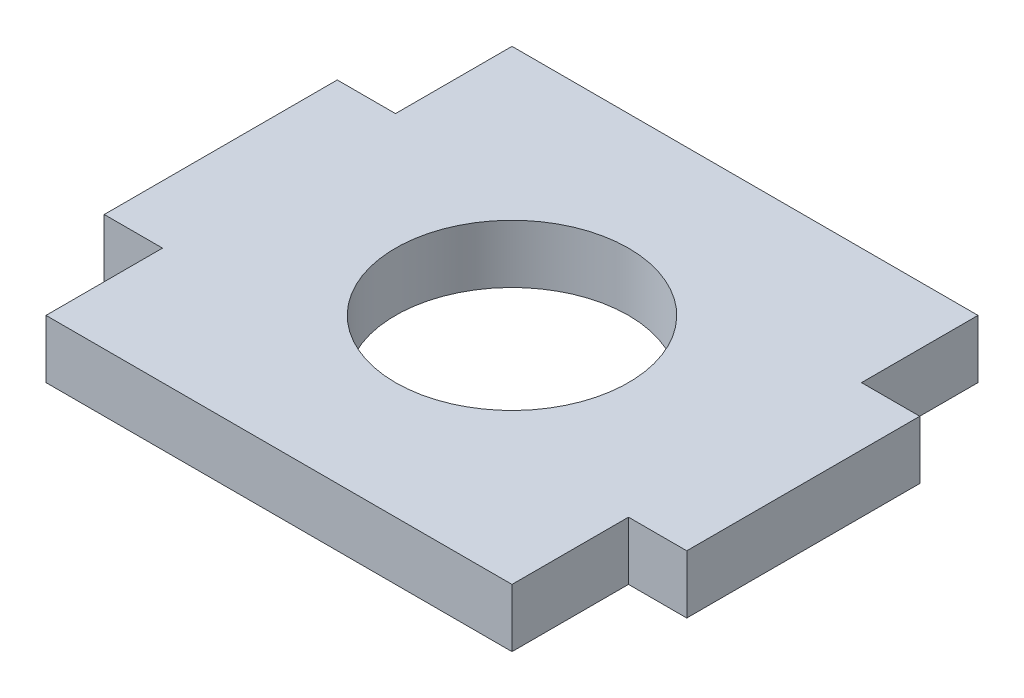
ISO-10303-21;
HEADER;
FILE_DESCRIPTION(('STEP AP214'),'2;1');
FILE_NAME('part.step','',(''),(''),'','','');
FILE_SCHEMA(('AUTOMOTIVE_DESIGN { 1 0 10303 214 1 1 1 1 }'));
ENDSEC;
DATA;
#1=APPLICATION_CONTEXT('core data for automotive mechanical design processes');
#2=APPLICATION_PROTOCOL_DEFINITION('international standard','automotive_design',2000,#1);
#3=PRODUCT_CONTEXT('',#1,'mechanical');
#4=PRODUCT('Part','Part','',(#3));
#5=PRODUCT_RELATED_PRODUCT_CATEGORY('part','',(#4));
#6=PRODUCT_DEFINITION_FORMATION('','',#4);
#7=PRODUCT_DEFINITION_CONTEXT('part definition',#1,'design');
#8=PRODUCT_DEFINITION('design','',#6,#7);
#9=PRODUCT_DEFINITION_SHAPE('','',#8);
#10=(LENGTH_UNIT() NAMED_UNIT(*) SI_UNIT(.MILLI.,.METRE.));
#11=(NAMED_UNIT(*) PLANE_ANGLE_UNIT() SI_UNIT($,.RADIAN.));
#12=(NAMED_UNIT(*) SI_UNIT($,.STERADIAN.) SOLID_ANGLE_UNIT());
#13=UNCERTAINTY_MEASURE_WITH_UNIT(LENGTH_MEASURE(1.E-05),#10,'distance_accuracy_value','');
#14=(GEOMETRIC_REPRESENTATION_CONTEXT(3) GLOBAL_UNCERTAINTY_ASSIGNED_CONTEXT((#13)) GLOBAL_UNIT_ASSIGNED_CONTEXT((#10,
#11,#12)) REPRESENTATION_CONTEXT('',''));
#15=CARTESIAN_POINT('',(0.,0.,0.));
#16=DIRECTION('',(0.,0.,1.));
#17=DIRECTION('',(1.,0.,0.));
#18=AXIS2_PLACEMENT_3D('',#15,#16,#17);
#19=CARTESIAN_POINT('',(12.7,3.175,-12.7));
#20=DIRECTION('',(0.,0.,1.));
#21=DIRECTION('',(1.,0.,0.));
#22=AXIS2_PLACEMENT_3D('',#19,#20,#21);
#23=PLANE('',#22);
#24=DIRECTION('',(-1.,0.,0.));
#25=VECTOR('',#24,1.);
#26=CARTESIAN_POINT('',(12.7,0.,-12.7));
#27=LINE('',#26,#25);
#28=CARTESIAN_POINT('',(12.7,0.,-12.7));
#29=VERTEX_POINT('',#28);
#30=CARTESIAN_POINT('',(-12.7,0.,-12.7));
#31=VERTEX_POINT('',#30);
#32=EDGE_CURVE('E202',#29,#31,#27,.T.);
#33=ORIENTED_EDGE('',*,*,#32,.T.);
#34=DIRECTION('',(0.,-1.,0.));
#35=VECTOR('',#34,1.);
#36=CARTESIAN_POINT('',(-12.7,3.175,-12.7));
#37=LINE('',#36,#35);
#38=CARTESIAN_POINT('',(-12.7,3.175,-12.7));
#39=VERTEX_POINT('',#38);
#40=EDGE_CURVE('E13',#39,#31,#37,.T.);
#41=ORIENTED_EDGE('',*,*,#40,.F.);
#42=DIRECTION('',(-1.,0.,0.));
#43=VECTOR('',#42,1.);
#44=CARTESIAN_POINT('',(12.7,3.175,-12.7));
#45=LINE('',#44,#43);
#46=CARTESIAN_POINT('',(12.7,3.175,-12.7));
#47=VERTEX_POINT('',#46);
#48=EDGE_CURVE('E237',#47,#39,#45,.T.);
#49=ORIENTED_EDGE('',*,*,#48,.F.);
#50=DIRECTION('',(0.,-1.,0.));
#51=VECTOR('',#50,1.);
#52=CARTESIAN_POINT('',(12.7,3.175,-12.7));
#53=LINE('',#52,#51);
#54=EDGE_CURVE('E198',#47,#29,#53,.T.);
#55=ORIENTED_EDGE('',*,*,#54,.T.);
#56=EDGE_LOOP('',(#33,#41,#49,#55));
#57=FACE_BOUND('',#56,.T.);
#58=ADVANCED_FACE('F53',(#57),#23,.F.);
#59=CARTESIAN_POINT('',(-12.7,3.175,-6.35));
#60=DIRECTION('',(1.,0.,0.));
#61=DIRECTION('',(0.,0.,-1.));
#62=AXIS2_PLACEMENT_3D('',#59,#60,#61);
#63=PLANE('',#62);
#64=DIRECTION('',(0.,0.,1.));
#65=VECTOR('',#64,1.);
#66=CARTESIAN_POINT('',(-12.7,0.,-6.35));
#67=LINE('',#66,#65);
#68=CARTESIAN_POINT('',(-12.7,0.,-6.35));
#69=VERTEX_POINT('',#68);
#70=EDGE_CURVE('E206',#31,#69,#67,.T.);
#71=ORIENTED_EDGE('',*,*,#70,.T.);
#72=DIRECTION('',(0.,-1.,0.));
#73=VECTOR('',#72,1.);
#74=CARTESIAN_POINT('',(-12.7,3.175,-6.35));
#75=LINE('',#74,#73);
#76=CARTESIAN_POINT('',(-12.7,3.175,-6.35));
#77=VERTEX_POINT('',#76);
#78=EDGE_CURVE('E62',#77,#69,#75,.T.);
#79=ORIENTED_EDGE('',*,*,#78,.F.);
#80=DIRECTION('',(0.,0.,1.));
#81=VECTOR('',#80,1.);
#82=CARTESIAN_POINT('',(-12.7,3.175,-6.35));
#83=LINE('',#82,#81);
#84=EDGE_CURVE('E140',#39,#77,#83,.T.);
#85=ORIENTED_EDGE('',*,*,#84,.F.);
#86=ORIENTED_EDGE('',*,*,#40,.T.);
#87=EDGE_LOOP('',(#71,#79,#85,#86));
#88=FACE_BOUND('',#87,.T.);
#89=ADVANCED_FACE('F323',(#88),#63,.F.);
#90=CARTESIAN_POINT('',(-12.7,3.175,-6.35));
#91=DIRECTION('',(0.,0.,1.));
#92=DIRECTION('',(1.,0.,0.));
#93=AXIS2_PLACEMENT_3D('',#90,#91,#92);
#94=PLANE('',#93);
#95=DIRECTION('',(-1.,0.,0.));
#96=VECTOR('',#95,1.);
#97=CARTESIAN_POINT('',(-12.7,0.,-6.35));
#98=LINE('',#97,#96);
#99=CARTESIAN_POINT('',(-15.875,0.,-6.35));
#100=VERTEX_POINT('',#99);
#101=EDGE_CURVE('E210',#69,#100,#98,.T.);
#102=ORIENTED_EDGE('',*,*,#101,.T.);
#103=DIRECTION('',(0.,-1.,0.));
#104=VECTOR('',#103,1.);
#105=CARTESIAN_POINT('',(-15.875,3.175,-6.35));
#106=LINE('',#105,#104);
#107=CARTESIAN_POINT('',(-15.875,3.175,-6.35));
#108=VERTEX_POINT('',#107);
#109=EDGE_CURVE('E264',#108,#100,#106,.T.);
#110=ORIENTED_EDGE('',*,*,#109,.F.);
#111=DIRECTION('',(-1.,0.,0.));
#112=VECTOR('',#111,1.);
#113=CARTESIAN_POINT('',(-12.7,3.175,-6.35));
#114=LINE('',#113,#112);
#115=EDGE_CURVE('E274',#77,#108,#114,.T.);
#116=ORIENTED_EDGE('',*,*,#115,.F.);
#117=ORIENTED_EDGE('',*,*,#78,.T.);
#118=EDGE_LOOP('',(#102,#110,#116,#117));
#119=FACE_BOUND('',#118,.T.);
#120=ADVANCED_FACE('F272',(#119),#94,.F.);
#121=CARTESIAN_POINT('',(-15.875,3.175,-6.35));
#122=DIRECTION('',(1.,0.,0.));
#123=DIRECTION('',(0.,0.,-1.));
#124=AXIS2_PLACEMENT_3D('',#121,#122,#123);
#125=PLANE('',#124);
#126=DIRECTION('',(0.,0.,1.));
#127=VECTOR('',#126,1.);
#128=CARTESIAN_POINT('',(-15.875,0.,-6.35));
#129=LINE('',#128,#127);
#130=CARTESIAN_POINT('',(-15.875,0.,6.35));
#131=VERTEX_POINT('',#130);
#132=EDGE_CURVE('E213',#100,#131,#129,.T.);
#133=ORIENTED_EDGE('',*,*,#132,.T.);
#134=DIRECTION('',(0.,-1.,0.));
#135=VECTOR('',#134,1.);
#136=CARTESIAN_POINT('',(-15.875,3.175,6.35));
#137=LINE('',#136,#135);
#138=CARTESIAN_POINT('',(-15.875,3.175,6.35));
#139=VERTEX_POINT('',#138);
#140=EDGE_CURVE('E260',#139,#131,#137,.T.);
#141=ORIENTED_EDGE('',*,*,#140,.F.);
#142=DIRECTION('',(0.,0.,1.));
#143=VECTOR('',#142,1.);
#144=CARTESIAN_POINT('',(-15.875,3.175,-6.35));
#145=LINE('',#144,#143);
#146=EDGE_CURVE('E293',#108,#139,#145,.T.);
#147=ORIENTED_EDGE('',*,*,#146,.F.);
#148=ORIENTED_EDGE('',*,*,#109,.T.);
#149=EDGE_LOOP('',(#133,#141,#147,#148));
#150=FACE_BOUND('',#149,.T.);
#151=ADVANCED_FACE('F283',(#150),#125,.F.);
#152=CARTESIAN_POINT('',(-12.7,3.175,6.35));
#153=DIRECTION('',(0.,0.,-1.));
#154=DIRECTION('',(-1.,0.,0.));
#155=AXIS2_PLACEMENT_3D('',#152,#153,#154);
#156=PLANE('',#155);
#157=DIRECTION('',(1.,0.,0.));
#158=VECTOR('',#157,1.);
#159=CARTESIAN_POINT('',(-12.7,0.,6.35));
#160=LINE('',#159,#158);
#161=CARTESIAN_POINT('',(-12.7,0.,6.35));
#162=VERTEX_POINT('',#161);
#163=EDGE_CURVE('E216',#131,#162,#160,.T.);
#164=ORIENTED_EDGE('',*,*,#163,.T.);
#165=DIRECTION('',(0.,-1.,0.));
#166=VECTOR('',#165,1.);
#167=CARTESIAN_POINT('',(-12.7,3.175,6.35));
#168=LINE('',#167,#166);
#169=CARTESIAN_POINT('',(-12.7,3.175,6.35));
#170=VERTEX_POINT('',#169);
#171=EDGE_CURVE('E256',#170,#162,#168,.T.);
#172=ORIENTED_EDGE('',*,*,#171,.F.);
#173=DIRECTION('',(1.,0.,0.));
#174=VECTOR('',#173,1.);
#175=CARTESIAN_POINT('',(-12.7,3.175,6.35));
#176=LINE('',#175,#174);
#177=EDGE_CURVE('E289',#139,#170,#176,.T.);
#178=ORIENTED_EDGE('',*,*,#177,.F.);
#179=ORIENTED_EDGE('',*,*,#140,.T.);
#180=EDGE_LOOP('',(#164,#172,#178,#179));
#181=FACE_BOUND('',#180,.T.);
#182=ADVANCED_FACE('F287',(#181),#156,.F.);
#183=CARTESIAN_POINT('',(-12.7,3.175,12.7));
#184=DIRECTION('',(1.,0.,0.));
#185=DIRECTION('',(0.,0.,-1.));
#186=AXIS2_PLACEMENT_3D('',#183,#184,#185);
#187=PLANE('',#186);
#188=DIRECTION('',(0.,0.,1.));
#189=VECTOR('',#188,1.);
#190=CARTESIAN_POINT('',(-12.7,0.,12.7));
#191=LINE('',#190,#189);
#192=CARTESIAN_POINT('',(-12.7,0.,12.7));
#193=VERTEX_POINT('',#192);
#194=EDGE_CURVE('E219',#162,#193,#191,.T.);
#195=ORIENTED_EDGE('',*,*,#194,.T.);
#196=DIRECTION('',(0.,-1.,0.));
#197=VECTOR('',#196,1.);
#198=CARTESIAN_POINT('',(-12.7,3.175,12.7));
#199=LINE('',#198,#197);
#200=CARTESIAN_POINT('',(-12.7,3.175,12.7));
#201=VERTEX_POINT('',#200);
#202=EDGE_CURVE('E252',#201,#193,#199,.T.);
#203=ORIENTED_EDGE('',*,*,#202,.F.);
#204=DIRECTION('',(0.,0.,1.));
#205=VECTOR('',#204,1.);
#206=CARTESIAN_POINT('',(-12.7,3.175,12.7));
#207=LINE('',#206,#205);
#208=EDGE_CURVE('E292',#170,#201,#207,.T.);
#209=ORIENTED_EDGE('',*,*,#208,.F.);
#210=ORIENTED_EDGE('',*,*,#171,.T.);
#211=EDGE_LOOP('',(#195,#203,#209,#210));
#212=FACE_BOUND('',#211,.T.);
#213=ADVANCED_FACE('F335',(#212),#187,.F.);
#214=CARTESIAN_POINT('',(12.7,3.175,12.7));
#215=DIRECTION('',(0.,0.,-1.));
#216=DIRECTION('',(-1.,0.,0.));
#217=AXIS2_PLACEMENT_3D('',#214,#215,#216);
#218=PLANE('',#217);
#219=DIRECTION('',(1.,0.,0.));
#220=VECTOR('',#219,1.);
#221=CARTESIAN_POINT('',(12.7,0.,12.7));
#222=LINE('',#221,#220);
#223=CARTESIAN_POINT('',(12.7,0.,12.7));
#224=VERTEX_POINT('',#223);
#225=EDGE_CURVE('E222',#193,#224,#222,.T.);
#226=ORIENTED_EDGE('',*,*,#225,.T.);
#227=DIRECTION('',(0.,-1.,0.));
#228=VECTOR('',#227,1.);
#229=CARTESIAN_POINT('',(12.7,3.175,12.7));
#230=LINE('',#229,#228);
#231=CARTESIAN_POINT('',(12.7,3.175,12.7));
#232=VERTEX_POINT('',#231);
#233=EDGE_CURVE('E248',#232,#224,#230,.T.);
#234=ORIENTED_EDGE('',*,*,#233,.F.);
#235=DIRECTION('',(1.,0.,0.));
#236=VECTOR('',#235,1.);
#237=CARTESIAN_POINT('',(12.7,3.175,12.7));
#238=LINE('',#237,#236);
#239=EDGE_CURVE('E296',#201,#232,#238,.T.);
#240=ORIENTED_EDGE('',*,*,#239,.F.);
#241=ORIENTED_EDGE('',*,*,#202,.T.);
#242=EDGE_LOOP('',(#226,#234,#240,#241));
#243=FACE_BOUND('',#242,.T.);
#244=ADVANCED_FACE('F338',(#243),#218,.F.);
#245=CARTESIAN_POINT('',(12.7,3.175,12.7));
#246=DIRECTION('',(-1.,0.,0.));
#247=DIRECTION('',(0.,0.,1.));
#248=AXIS2_PLACEMENT_3D('',#245,#246,#247);
#249=PLANE('',#248);
#250=DIRECTION('',(0.,0.,-1.));
#251=VECTOR('',#250,1.);
#252=CARTESIAN_POINT('',(12.7,0.,12.7));
#253=LINE('',#252,#251);
#254=CARTESIAN_POINT('',(12.7,0.,6.35));
#255=VERTEX_POINT('',#254);
#256=EDGE_CURVE('E225',#224,#255,#253,.T.);
#257=ORIENTED_EDGE('',*,*,#256,.T.);
#258=DIRECTION('',(0.,-1.,0.));
#259=VECTOR('',#258,1.);
#260=CARTESIAN_POINT('',(12.7,3.175,6.35));
#261=LINE('',#260,#259);
#262=CARTESIAN_POINT('',(12.7,3.175,6.35));
#263=VERTEX_POINT('',#262);
#264=EDGE_CURVE('E244',#263,#255,#261,.T.);
#265=ORIENTED_EDGE('',*,*,#264,.F.);
#266=DIRECTION('',(0.,0.,-1.));
#267=VECTOR('',#266,1.);
#268=CARTESIAN_POINT('',(12.7,3.175,12.7));
#269=LINE('',#268,#267);
#270=EDGE_CURVE('E304',#232,#263,#269,.T.);
#271=ORIENTED_EDGE('',*,*,#270,.F.);
#272=ORIENTED_EDGE('',*,*,#233,.T.);
#273=EDGE_LOOP('',(#257,#265,#271,#272));
#274=FACE_BOUND('',#273,.T.);
#275=ADVANCED_FACE('F342',(#274),#249,.F.);
#276=CARTESIAN_POINT('',(12.7,3.175,6.35));
#277=DIRECTION('',(0.,0.,-1.));
#278=DIRECTION('',(-1.,0.,0.));
#279=AXIS2_PLACEMENT_3D('',#276,#277,#278);
#280=PLANE('',#279);
#281=DIRECTION('',(1.,0.,0.));
#282=VECTOR('',#281,1.);
#283=CARTESIAN_POINT('',(12.7,0.,6.35));
#284=LINE('',#283,#282);
#285=CARTESIAN_POINT('',(15.875,0.,6.35));
#286=VERTEX_POINT('',#285);
#287=EDGE_CURVE('E228',#255,#286,#284,.T.);
#288=ORIENTED_EDGE('',*,*,#287,.T.);
#289=DIRECTION('',(0.,-1.,0.));
#290=VECTOR('',#289,1.);
#291=CARTESIAN_POINT('',(15.875,3.175,6.35));
#292=LINE('',#291,#290);
#293=CARTESIAN_POINT('',(15.875,3.175,6.35));
#294=VERTEX_POINT('',#293);
#295=EDGE_CURVE('E190',#294,#286,#292,.T.);
#296=ORIENTED_EDGE('',*,*,#295,.F.);
#297=DIRECTION('',(1.,0.,0.));
#298=VECTOR('',#297,1.);
#299=CARTESIAN_POINT('',(12.7,3.175,6.35));
#300=LINE('',#299,#298);
#301=EDGE_CURVE('E179',#263,#294,#300,.T.);
#302=ORIENTED_EDGE('',*,*,#301,.F.);
#303=ORIENTED_EDGE('',*,*,#264,.T.);
#304=EDGE_LOOP('',(#288,#296,#302,#303));
#305=FACE_BOUND('',#304,.T.);
#306=ADVANCED_FACE('F346',(#305),#280,.F.);
#307=CARTESIAN_POINT('',(15.875,3.175,-6.35));
#308=DIRECTION('',(-1.,0.,0.));
#309=DIRECTION('',(0.,0.,1.));
#310=AXIS2_PLACEMENT_3D('',#307,#308,#309);
#311=PLANE('',#310);
#312=DIRECTION('',(0.,0.,-1.));
#313=VECTOR('',#312,1.);
#314=CARTESIAN_POINT('',(15.875,0.,-6.35));
#315=LINE('',#314,#313);
#316=CARTESIAN_POINT('',(15.875,0.,-6.35));
#317=VERTEX_POINT('',#316);
#318=EDGE_CURVE('E188',#286,#317,#315,.T.);
#319=ORIENTED_EDGE('',*,*,#318,.T.);
#320=DIRECTION('',(0.,-1.,0.));
#321=VECTOR('',#320,1.);
#322=CARTESIAN_POINT('',(15.875,3.175,-6.35));
#323=LINE('',#322,#321);
#324=CARTESIAN_POINT('',(15.875,3.175,-6.35));
#325=VERTEX_POINT('',#324);
#326=EDGE_CURVE('E185',#325,#317,#323,.T.);
#327=ORIENTED_EDGE('',*,*,#326,.F.);
#328=DIRECTION('',(0.,0.,-1.));
#329=VECTOR('',#328,1.);
#330=CARTESIAN_POINT('',(15.875,3.175,-6.35));
#331=LINE('',#330,#329);
#332=EDGE_CURVE('E173',#294,#325,#331,.T.);
#333=ORIENTED_EDGE('',*,*,#332,.F.);
#334=ORIENTED_EDGE('',*,*,#295,.T.);
#335=EDGE_LOOP('',(#319,#327,#333,#334));
#336=FACE_BOUND('',#335,.T.);
#337=ADVANCED_FACE('F186',(#336),#311,.F.);
#338=CARTESIAN_POINT('',(12.7,3.175,-6.35));
#339=DIRECTION('',(0.,0.,1.));
#340=DIRECTION('',(1.,0.,0.));
#341=AXIS2_PLACEMENT_3D('',#338,#339,#340);
#342=PLANE('',#341);
#343=DIRECTION('',(-1.,0.,0.));
#344=VECTOR('',#343,1.);
#345=CARTESIAN_POINT('',(12.7,0.,-6.35));
#346=LINE('',#345,#344);
#347=CARTESIAN_POINT('',(12.7,0.,-6.35));
#348=VERTEX_POINT('',#347);
#349=EDGE_CURVE('E126',#317,#348,#346,.T.);
#350=ORIENTED_EDGE('',*,*,#349,.T.);
#351=DIRECTION('',(0.,-1.,0.));
#352=VECTOR('',#351,1.);
#353=CARTESIAN_POINT('',(12.7,3.175,-6.35));
#354=LINE('',#353,#352);
#355=CARTESIAN_POINT('',(12.7,3.175,-6.35));
#356=VERTEX_POINT('',#355);
#357=EDGE_CURVE('E191',#356,#348,#354,.T.);
#358=ORIENTED_EDGE('',*,*,#357,.F.);
#359=DIRECTION('',(-1.,0.,0.));
#360=VECTOR('',#359,1.);
#361=CARTESIAN_POINT('',(12.7,3.175,-6.35));
#362=LINE('',#361,#360);
#363=EDGE_CURVE('E177',#325,#356,#362,.T.);
#364=ORIENTED_EDGE('',*,*,#363,.F.);
#365=ORIENTED_EDGE('',*,*,#326,.T.);
#366=EDGE_LOOP('',(#350,#358,#364,#365));
#367=FACE_BOUND('',#366,.T.);
#368=ADVANCED_FACE('F193',(#367),#342,.F.);
#369=CARTESIAN_POINT('',(12.7,3.175,-6.35));
#370=DIRECTION('',(-1.,0.,0.));
#371=DIRECTION('',(0.,0.,1.));
#372=AXIS2_PLACEMENT_3D('',#369,#370,#371);
#373=PLANE('',#372);
#374=DIRECTION('',(0.,0.,-1.));
#375=VECTOR('',#374,1.);
#376=CARTESIAN_POINT('',(12.7,0.,-6.35));
#377=LINE('',#376,#375);
#378=EDGE_CURVE('E132',#348,#29,#377,.T.);
#379=ORIENTED_EDGE('',*,*,#378,.T.);
#380=ORIENTED_EDGE('',*,*,#54,.F.);
#381=DIRECTION('',(0.,0.,-1.));
#382=VECTOR('',#381,1.);
#383=CARTESIAN_POINT('',(12.7,3.175,-6.35));
#384=LINE('',#383,#382);
#385=EDGE_CURVE('E73',#356,#47,#384,.T.);
#386=ORIENTED_EDGE('',*,*,#385,.F.);
#387=ORIENTED_EDGE('',*,*,#357,.T.);
#388=EDGE_LOOP('',(#379,#380,#386,#387));
#389=FACE_BOUND('',#388,.T.);
#390=ADVANCED_FACE('F355',(#389),#373,.F.);
#391=CARTESIAN_POINT('',(0.,3.175,0.));
#392=DIRECTION('',(0.,-1.,0.));
#393=DIRECTION('',(0.,0.,-1.));
#394=AXIS2_PLACEMENT_3D('',#391,#392,#393);
#395=PLANE('',#394);
#396=CARTESIAN_POINT('',(0.,3.175,0.));
#397=DIRECTION('',(0.,1.,0.));
#398=DIRECTION('',(0.,0.,1.));
#399=AXIS2_PLACEMENT_3D('',#396,#397,#398);
#400=CIRCLE('',#399,6.35);
#401=CARTESIAN_POINT('',(0.,3.175,6.35));
#402=VERTEX_POINT('',#401);
#403=EDGE_CURVE('E310',#402,#402,#400,.T.);
#404=ORIENTED_EDGE('',*,*,#403,.F.);
#405=EDGE_LOOP('',(#404));
#406=FACE_BOUND('',#405,.T.);
#407=ORIENTED_EDGE('',*,*,#48,.T.);
#408=ORIENTED_EDGE('',*,*,#84,.T.);
#409=ORIENTED_EDGE('',*,*,#115,.T.);
#410=ORIENTED_EDGE('',*,*,#146,.T.);
#411=ORIENTED_EDGE('',*,*,#177,.T.);
#412=ORIENTED_EDGE('',*,*,#208,.T.);
#413=ORIENTED_EDGE('',*,*,#239,.T.);
#414=ORIENTED_EDGE('',*,*,#270,.T.);
#415=ORIENTED_EDGE('',*,*,#301,.T.);
#416=ORIENTED_EDGE('',*,*,#332,.T.);
#417=ORIENTED_EDGE('',*,*,#363,.T.);
#418=ORIENTED_EDGE('',*,*,#385,.T.);
#419=EDGE_LOOP('',(#407,#408,#409,#410,#411,#412,#413,#414,#415,#416,#417,#418));
#420=FACE_BOUND('',#419,.T.);
#421=ADVANCED_FACE('F175',(#406,#420),#395,.F.);
#422=CARTESIAN_POINT('',(0.,0.,0.));
#423=DIRECTION('',(0.,-1.,0.));
#424=DIRECTION('',(0.,0.,-1.));
#425=AXIS2_PLACEMENT_3D('',#422,#423,#424);
#426=PLANE('',#425);
#427=CARTESIAN_POINT('',(0.,0.,0.));
#428=DIRECTION('',(0.,1.,0.));
#429=DIRECTION('',(0.,0.,1.));
#430=AXIS2_PLACEMENT_3D('',#427,#428,#429);
#431=CIRCLE('',#430,6.35);
#432=CARTESIAN_POINT('',(0.,0.,6.35));
#433=VERTEX_POINT('',#432);
#434=EDGE_CURVE('E207',#433,#433,#431,.T.);
#435=ORIENTED_EDGE('',*,*,#434,.T.);
#436=EDGE_LOOP('',(#435));
#437=FACE_BOUND('',#436,.T.);
#438=ORIENTED_EDGE('',*,*,#32,.F.);
#439=ORIENTED_EDGE('',*,*,#378,.F.);
#440=ORIENTED_EDGE('',*,*,#349,.F.);
#441=ORIENTED_EDGE('',*,*,#318,.F.);
#442=ORIENTED_EDGE('',*,*,#287,.F.);
#443=ORIENTED_EDGE('',*,*,#256,.F.);
#444=ORIENTED_EDGE('',*,*,#225,.F.);
#445=ORIENTED_EDGE('',*,*,#194,.F.);
#446=ORIENTED_EDGE('',*,*,#163,.F.);
#447=ORIENTED_EDGE('',*,*,#132,.F.);
#448=ORIENTED_EDGE('',*,*,#101,.F.);
#449=ORIENTED_EDGE('',*,*,#70,.F.);
#450=EDGE_LOOP('',(#438,#439,#440,#441,#442,#443,#444,#445,#446,#447,#448,#449));
#451=FACE_BOUND('',#450,.T.);
#452=ADVANCED_FACE('F278',(#437,#451),#426,.T.);
#453=CARTESIAN_POINT('',(0.,0.,0.));
#454=DIRECTION('',(0.,1.,0.));
#455=DIRECTION('',(0.,0.,1.));
#456=AXIS2_PLACEMENT_3D('',#453,#454,#455);
#457=CYLINDRICAL_SURFACE('',#456,6.35);
#458=ORIENTED_EDGE('',*,*,#434,.F.);
#459=EDGE_LOOP('',(#458));
#460=FACE_BOUND('',#459,.T.);
#461=ORIENTED_EDGE('',*,*,#403,.T.);
#462=EDGE_LOOP('',(#461));
#463=FACE_BOUND('',#462,.T.);
#464=ADVANCED_FACE('F360',(#460,#463),#457,.F.);
#465=CLOSED_SHELL('',(#58,#89,#120,#151,#182,#213,#244,#275,#306,#337,#368,#390,#421,#452,#464));
#466=MANIFOLD_SOLID_BREP('B2',#465);
#467=ADVANCED_BREP_SHAPE_REPRESENTATION('',(#18,#466),#14);
#468=SHAPE_DEFINITION_REPRESENTATION(#9,#467);
ENDSEC;
END-ISO-10303-21;
